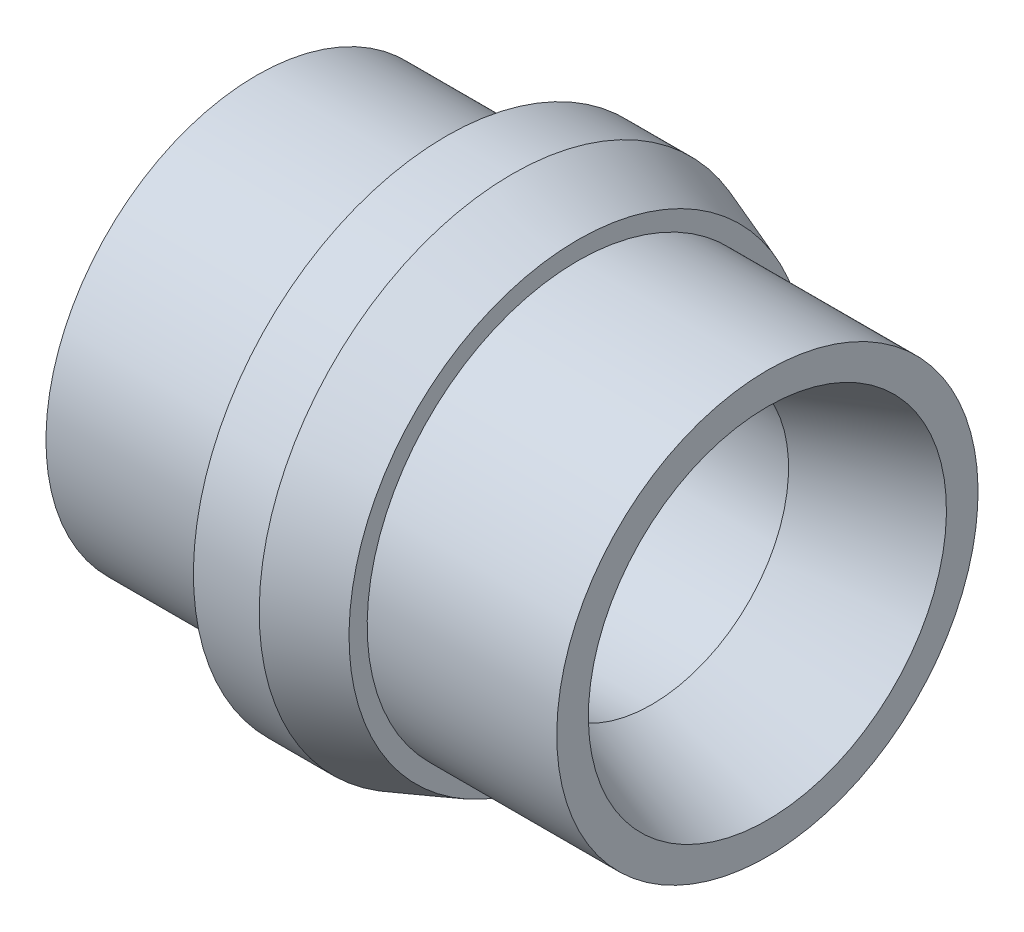
ISO-10303-21;
HEADER;
FILE_DESCRIPTION(('STEP AP214'),'2;1');
FILE_NAME('part.step','',(''),(''),'','','');
FILE_SCHEMA(('AUTOMOTIVE_DESIGN { 1 0 10303 214 1 1 1 1 }'));
ENDSEC;
DATA;
#1=APPLICATION_CONTEXT('core data for automotive mechanical design processes');
#2=APPLICATION_PROTOCOL_DEFINITION('international standard','automotive_design',2000,#1);
#3=PRODUCT_CONTEXT('',#1,'mechanical');
#4=PRODUCT('Part','Part','',(#3));
#5=PRODUCT_RELATED_PRODUCT_CATEGORY('part','',(#4));
#6=PRODUCT_DEFINITION_FORMATION('','',#4);
#7=PRODUCT_DEFINITION_CONTEXT('part definition',#1,'design');
#8=PRODUCT_DEFINITION('design','',#6,#7);
#9=PRODUCT_DEFINITION_SHAPE('','',#8);
#10=(LENGTH_UNIT() NAMED_UNIT(*) SI_UNIT(.MILLI.,.METRE.));
#11=(NAMED_UNIT(*) PLANE_ANGLE_UNIT() SI_UNIT($,.RADIAN.));
#12=(NAMED_UNIT(*) SI_UNIT($,.STERADIAN.) SOLID_ANGLE_UNIT());
#13=UNCERTAINTY_MEASURE_WITH_UNIT(LENGTH_MEASURE(1.E-05),#10,'distance_accuracy_value','');
#14=(GEOMETRIC_REPRESENTATION_CONTEXT(3) GLOBAL_UNCERTAINTY_ASSIGNED_CONTEXT((#13)) GLOBAL_UNIT_ASSIGNED_CONTEXT((#10,
#11,#12)) REPRESENTATION_CONTEXT('',''));
#15=CARTESIAN_POINT('',(0.,0.,0.));
#16=DIRECTION('',(0.,0.,1.));
#17=DIRECTION('',(1.,0.,0.));
#18=AXIS2_PLACEMENT_3D('',#15,#16,#17);
#19=CARTESIAN_POINT('',(0.,5.08,0.));
#20=DIRECTION('',(-1.,0.,0.));
#21=DIRECTION('',(0.,-1.,0.));
#22=AXIS2_PLACEMENT_3D('',#19,#20,#21);
#23=PLANE('',#22);
#24=CARTESIAN_POINT('',(0.,0.,0.));
#25=DIRECTION('',(1.,0.,0.));
#26=DIRECTION('',(0.,1.,0.));
#27=AXIS2_PLACEMENT_3D('',#24,#25,#26);
#28=CIRCLE('',#27,5.08);
#29=CARTESIAN_POINT('',(0.,5.08,0.));
#30=VERTEX_POINT('',#29);
#31=EDGE_CURVE('E73',#30,#30,#28,.T.);
#32=ORIENTED_EDGE('',*,*,#31,.T.);
#33=EDGE_LOOP('',(#32));
#34=FACE_BOUND('',#33,.T.);
#35=CARTESIAN_POINT('',(0.,0.,0.));
#36=DIRECTION('',(1.,0.,0.));
#37=DIRECTION('',(0.,1.,0.));
#38=AXIS2_PLACEMENT_3D('',#35,#36,#37);
#39=CIRCLE('',#38,6.096);
#40=CARTESIAN_POINT('',(0.,6.096,0.));
#41=VERTEX_POINT('',#40);
#42=EDGE_CURVE('E10',#41,#41,#39,.T.);
#43=ORIENTED_EDGE('',*,*,#42,.F.);
#44=EDGE_LOOP('',(#43));
#45=FACE_BOUND('',#44,.T.);
#46=ADVANCED_FACE('F39',(#34,#45),#23,.T.);
#47=CARTESIAN_POINT('',(3.86893060941692,0.,0.));
#48=DIRECTION('',(1.,0.,0.));
#49=DIRECTION('',(0.,1.,0.));
#50=AXIS2_PLACEMENT_3D('',#47,#48,#49);
#51=CYLINDRICAL_SURFACE('',#50,6.096);
#52=ORIENTED_EDGE('',*,*,#42,.T.);
#53=EDGE_LOOP('',(#52));
#54=FACE_BOUND('',#53,.T.);
#55=CARTESIAN_POINT('',(1.5875,0.,0.));
#56=DIRECTION('',(1.,0.,0.));
#57=DIRECTION('',(0.,1.,0.));
#58=AXIS2_PLACEMENT_3D('',#55,#56,#57);
#59=CIRCLE('',#58,6.096);
#60=CARTESIAN_POINT('',(1.5875,6.096,0.));
#61=VERTEX_POINT('',#60);
#62=EDGE_CURVE('E45',#61,#61,#59,.T.);
#63=ORIENTED_EDGE('',*,*,#62,.F.);
#64=EDGE_LOOP('',(#63));
#65=FACE_BOUND('',#64,.T.);
#66=ADVANCED_FACE('F91',(#54,#65),#51,.T.);
#67=CARTESIAN_POINT('',(3.175,0.,0.));
#68=DIRECTION('',(-1.,0.,0.));
#69=DIRECTION('',(0.,-1.,0.));
#70=AXIS2_PLACEMENT_3D('',#67,#68,#69);
#71=CONICAL_SURFACE('',#70,5.5181972531024,0.349065850398867);
#72=ORIENTED_EDGE('',*,*,#62,.T.);
#73=EDGE_LOOP('',(#72));
#74=FACE_BOUND('',#73,.T.);
#75=CARTESIAN_POINT('',(3.175,0.,0.));
#76=DIRECTION('',(1.,0.,0.));
#77=DIRECTION('',(0.,1.,0.));
#78=AXIS2_PLACEMENT_3D('',#75,#76,#77);
#79=CIRCLE('',#78,5.5181972531024);
#80=CARTESIAN_POINT('',(3.175,5.5181972531024,0.));
#81=VERTEX_POINT('',#80);
#82=EDGE_CURVE('E49',#81,#81,#79,.T.);
#83=ORIENTED_EDGE('',*,*,#82,.F.);
#84=EDGE_LOOP('',(#83));
#85=FACE_BOUND('',#84,.T.);
#86=ADVANCED_FACE('F95',(#74,#85),#71,.T.);
#87=CARTESIAN_POINT('',(3.175,5.5181972531024,0.));
#88=DIRECTION('',(1.,0.,0.));
#89=DIRECTION('',(0.,1.,0.));
#90=AXIS2_PLACEMENT_3D('',#87,#88,#89);
#91=PLANE('',#90);
#92=ORIENTED_EDGE('',*,*,#82,.T.);
#93=EDGE_LOOP('',(#92));
#94=FACE_BOUND('',#93,.T.);
#95=CARTESIAN_POINT('',(3.175,0.,0.));
#96=DIRECTION('',(1.,0.,0.));
#97=DIRECTION('',(0.,1.,0.));
#98=AXIS2_PLACEMENT_3D('',#95,#96,#97);
#99=CIRCLE('',#98,5.08);
#100=CARTESIAN_POINT('',(3.175,5.08,0.));
#101=VERTEX_POINT('',#100);
#102=EDGE_CURVE('E53',#101,#101,#99,.T.);
#103=ORIENTED_EDGE('',*,*,#102,.F.);
#104=EDGE_LOOP('',(#103));
#105=FACE_BOUND('',#104,.T.);
#106=ADVANCED_FACE('F99',(#94,#105),#91,.T.);
#107=CARTESIAN_POINT('',(3.86893060941692,0.,0.));
#108=DIRECTION('',(1.,0.,0.));
#109=DIRECTION('',(0.,1.,0.));
#110=AXIS2_PLACEMENT_3D('',#107,#108,#109);
#111=CYLINDRICAL_SURFACE('',#110,5.08);
#112=ORIENTED_EDGE('',*,*,#102,.T.);
#113=EDGE_LOOP('',(#112));
#114=FACE_BOUND('',#113,.T.);
#115=CARTESIAN_POINT('',(7.747,0.,0.));
#116=DIRECTION('',(1.,0.,0.));
#117=DIRECTION('',(0.,1.,0.));
#118=AXIS2_PLACEMENT_3D('',#115,#116,#117);
#119=CIRCLE('',#118,5.08);
#120=CARTESIAN_POINT('',(7.747,5.08,0.));
#121=VERTEX_POINT('',#120);
#122=EDGE_CURVE('E58',#121,#121,#119,.T.);
#123=ORIENTED_EDGE('',*,*,#122,.F.);
#124=EDGE_LOOP('',(#123));
#125=FACE_BOUND('',#124,.T.);
#126=ADVANCED_FACE('F105',(#114,#125),#111,.T.);
#127=CARTESIAN_POINT('',(7.747,5.08,0.));
#128=DIRECTION('',(1.,0.,0.));
#129=DIRECTION('',(0.,1.,0.));
#130=AXIS2_PLACEMENT_3D('',#127,#128,#129);
#131=PLANE('',#130);
#132=ORIENTED_EDGE('',*,*,#122,.T.);
#133=EDGE_LOOP('',(#132));
#134=FACE_BOUND('',#133,.T.);
#135=CARTESIAN_POINT('',(7.747,0.,0.));
#136=DIRECTION('',(1.,0.,0.));
#137=DIRECTION('',(0.,1.,0.));
#138=AXIS2_PLACEMENT_3D('',#135,#136,#137);
#139=CIRCLE('',#138,4.318);
#140=CARTESIAN_POINT('',(7.747,4.318,0.));
#141=VERTEX_POINT('',#140);
#142=EDGE_CURVE('E61',#141,#141,#139,.T.);
#143=ORIENTED_EDGE('',*,*,#142,.F.);
#144=EDGE_LOOP('',(#143));
#145=FACE_BOUND('',#144,.T.);
#146=ADVANCED_FACE('F109',(#134,#145),#131,.T.);
#147=CARTESIAN_POINT('',(4.95556294183411,0.,0.));
#148=DIRECTION('',(1.,0.,0.));
#149=DIRECTION('',(0.,1.,0.));
#150=AXIS2_PLACEMENT_3D('',#147,#148,#149);
#151=CONICAL_SURFACE('',#150,3.302,0.349065850398866);
#152=ORIENTED_EDGE('',*,*,#142,.T.);
#153=EDGE_LOOP('',(#152));
#154=FACE_BOUND('',#153,.T.);
#155=CARTESIAN_POINT('',(4.95556294183411,0.,0.));
#156=DIRECTION('',(1.,0.,0.));
#157=DIRECTION('',(0.,1.,0.));
#158=AXIS2_PLACEMENT_3D('',#155,#156,#157);
#159=CIRCLE('',#158,3.302);
#160=CARTESIAN_POINT('',(4.95556294183411,3.302,0.));
#161=VERTEX_POINT('',#160);
#162=EDGE_CURVE('E64',#161,#161,#159,.T.);
#163=ORIENTED_EDGE('',*,*,#162,.F.);
#164=EDGE_LOOP('',(#163));
#165=FACE_BOUND('',#164,.T.);
#166=ADVANCED_FACE('F113',(#154,#165),#151,.F.);
#167=CARTESIAN_POINT('',(3.86893060941692,0.,0.));
#168=DIRECTION('',(1.,0.,0.));
#169=DIRECTION('',(0.,1.,0.));
#170=AXIS2_PLACEMENT_3D('',#167,#168,#169);
#171=CYLINDRICAL_SURFACE('',#170,3.302);
#172=ORIENTED_EDGE('',*,*,#162,.T.);
#173=EDGE_LOOP('',(#172));
#174=FACE_BOUND('',#173,.T.);
#175=CARTESIAN_POINT('',(-4.572,0.,0.));
#176=DIRECTION('',(1.,0.,0.));
#177=DIRECTION('',(0.,1.,0.));
#178=AXIS2_PLACEMENT_3D('',#175,#176,#177);
#179=CIRCLE('',#178,3.302);
#180=CARTESIAN_POINT('',(-4.572,3.302,0.));
#181=VERTEX_POINT('',#180);
#182=EDGE_CURVE('E67',#181,#181,#179,.T.);
#183=ORIENTED_EDGE('',*,*,#182,.F.);
#184=EDGE_LOOP('',(#183));
#185=FACE_BOUND('',#184,.T.);
#186=ADVANCED_FACE('F87',(#174,#185),#171,.F.);
#187=CARTESIAN_POINT('',(-4.572,3.302,0.));
#188=DIRECTION('',(-1.,0.,0.));
#189=DIRECTION('',(0.,-1.,0.));
#190=AXIS2_PLACEMENT_3D('',#187,#188,#189);
#191=PLANE('',#190);
#192=ORIENTED_EDGE('',*,*,#182,.T.);
#193=EDGE_LOOP('',(#192));
#194=FACE_BOUND('',#193,.T.);
#195=CARTESIAN_POINT('',(-4.572,0.,0.));
#196=DIRECTION('',(1.,0.,0.));
#197=DIRECTION('',(0.,1.,0.));
#198=AXIS2_PLACEMENT_3D('',#195,#196,#197);
#199=CIRCLE('',#198,5.08);
#200=CARTESIAN_POINT('',(-4.572,5.08,0.));
#201=VERTEX_POINT('',#200);
#202=EDGE_CURVE('E70',#201,#201,#199,.T.);
#203=ORIENTED_EDGE('',*,*,#202,.F.);
#204=EDGE_LOOP('',(#203));
#205=FACE_BOUND('',#204,.T.);
#206=ADVANCED_FACE('F81',(#194,#205),#191,.T.);
#207=CARTESIAN_POINT('',(3.86893060941692,0.,0.));
#208=DIRECTION('',(1.,0.,0.));
#209=DIRECTION('',(0.,1.,0.));
#210=AXIS2_PLACEMENT_3D('',#207,#208,#209);
#211=CYLINDRICAL_SURFACE('',#210,5.08);
#212=ORIENTED_EDGE('',*,*,#202,.T.);
#213=EDGE_LOOP('',(#212));
#214=FACE_BOUND('',#213,.T.);
#215=ORIENTED_EDGE('',*,*,#31,.F.);
#216=EDGE_LOOP('',(#215));
#217=FACE_BOUND('',#216,.T.);
#218=ADVANCED_FACE('F79',(#214,#217),#211,.T.);
#219=CLOSED_SHELL('',(#46,#66,#86,#106,#126,#146,#166,#186,#206,#218));
#220=MANIFOLD_SOLID_BREP('B2',#219);
#221=ADVANCED_BREP_SHAPE_REPRESENTATION('',(#18,#220),#14);
#222=SHAPE_DEFINITION_REPRESENTATION(#9,#221);
ENDSEC;
END-ISO-10303-21;
